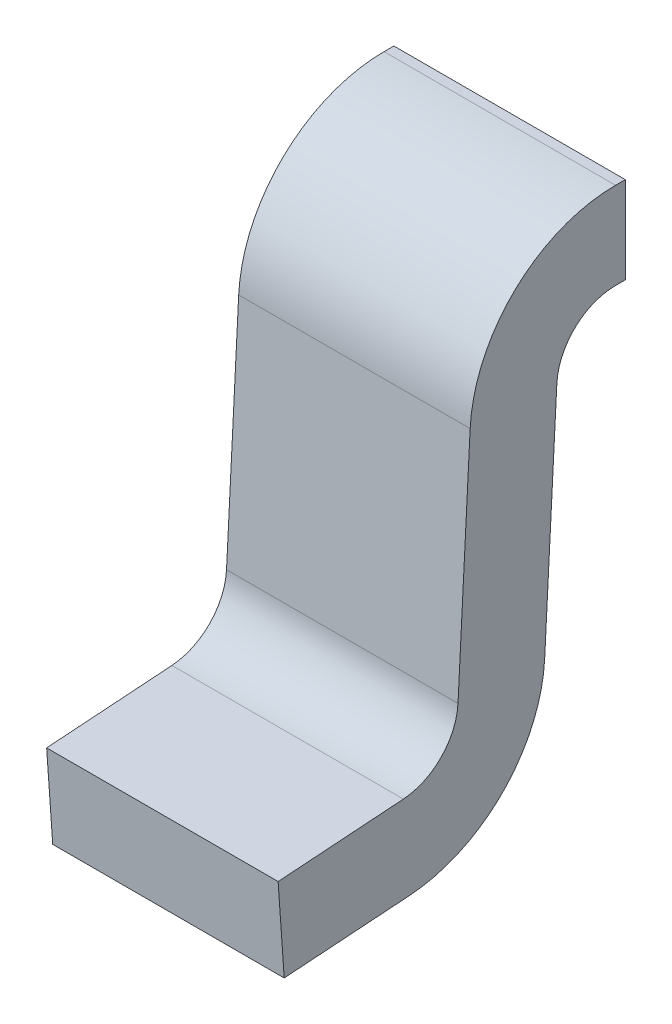
ISO-10303-21;
HEADER;
FILE_DESCRIPTION(('STEP AP214'),'2;1');
FILE_NAME('part.step','',(''),(''),'','','');
FILE_SCHEMA(('AUTOMOTIVE_DESIGN { 1 0 10303 214 1 1 1 1 }'));
ENDSEC;
DATA;
#1=APPLICATION_CONTEXT('core data for automotive mechanical design processes');
#2=APPLICATION_PROTOCOL_DEFINITION('international standard','automotive_design',2000,#1);
#3=PRODUCT_CONTEXT('',#1,'mechanical');
#4=PRODUCT('Part','Part','',(#3));
#5=PRODUCT_RELATED_PRODUCT_CATEGORY('part','',(#4));
#6=PRODUCT_DEFINITION_FORMATION('','',#4);
#7=PRODUCT_DEFINITION_CONTEXT('part definition',#1,'design');
#8=PRODUCT_DEFINITION('design','',#6,#7);
#9=PRODUCT_DEFINITION_SHAPE('','',#8);
#10=(LENGTH_UNIT() NAMED_UNIT(*) SI_UNIT(.MILLI.,.METRE.));
#11=(NAMED_UNIT(*) PLANE_ANGLE_UNIT() SI_UNIT($,.RADIAN.));
#12=(NAMED_UNIT(*) SI_UNIT($,.STERADIAN.) SOLID_ANGLE_UNIT());
#13=UNCERTAINTY_MEASURE_WITH_UNIT(LENGTH_MEASURE(1.E-05),#10,'distance_accuracy_value','');
#14=(GEOMETRIC_REPRESENTATION_CONTEXT(3) GLOBAL_UNCERTAINTY_ASSIGNED_CONTEXT((#13)) GLOBAL_UNIT_ASSIGNED_CONTEXT((#10,
#11,#12)) REPRESENTATION_CONTEXT('',''));
#15=CARTESIAN_POINT('',(0.,0.,0.));
#16=DIRECTION('',(0.,0.,1.));
#17=DIRECTION('',(1.,0.,0.));
#18=AXIS2_PLACEMENT_3D('',#15,#16,#17);
#19=CARTESIAN_POINT('',(-0.2,0.01612280193581,0.251100322008));
#20=DIRECTION('',(-1.,0.,0.));
#21=DIRECTION('',(0.,-0.0523359562429177,-0.998629534754575));
#22=AXIS2_PLACEMENT_3D('',#19,#20,#21);
#23=CYLINDRICAL_SURFACE('',#22,0.2516);
#24=CARTESIAN_POINT('',(0.2,0.01612280193581,0.251100322008));
#25=DIRECTION('',(-1.,0.,0.));
#26=DIRECTION('',(0.,-0.0523359562429177,-0.998629534754575));
#27=AXIS2_PLACEMENT_3D('',#24,#25,#26);
#28=CIRCLE('',#27,0.2516);
#29=CARTESIAN_POINT('',(0.2,0.002955075345083,-0.0001548689364499));
#30=VERTEX_POINT('',#29);
#31=CARTESIAN_POINT('',(0.2,-0.23486431311,0.233549593214));
#32=VERTEX_POINT('',#31);
#33=EDGE_CURVE('E228',#30,#32,#28,.T.);
#34=ORIENTED_EDGE('',*,*,#33,.T.);
#35=DIRECTION('',(1.,0.,0.));
#36=VECTOR('',#35,1.);
#37=CARTESIAN_POINT('',(-0.2,-0.23486431311,0.233549593214));
#38=LINE('',#37,#36);
#39=CARTESIAN_POINT('',(-0.2,-0.23486431311,0.233549593214));
#40=VERTEX_POINT('',#39);
#41=EDGE_CURVE('E11',#40,#32,#38,.T.);
#42=ORIENTED_EDGE('',*,*,#41,.F.);
#43=CARTESIAN_POINT('',(-0.2,0.01612280193581,0.251100322008));
#44=DIRECTION('',(-1.,0.,0.));
#45=DIRECTION('',(0.,-0.0523359562429177,-0.998629534754575));
#46=AXIS2_PLACEMENT_3D('',#43,#44,#45);
#47=CIRCLE('',#46,0.2516);
#48=CARTESIAN_POINT('',(-0.2,0.002955075345083,-0.0001548689364499));
#49=VERTEX_POINT('',#48);
#50=EDGE_CURVE('E156',#49,#40,#47,.T.);
#51=ORIENTED_EDGE('',*,*,#50,.F.);
#52=DIRECTION('',(1.,0.,0.));
#53=VECTOR('',#52,1.);
#54=CARTESIAN_POINT('',(-0.2,0.002955075345083,-0.0001548689364499));
#55=LINE('',#54,#53);
#56=EDGE_CURVE('E138',#49,#30,#55,.T.);
#57=ORIENTED_EDGE('',*,*,#56,.T.);
#58=EDGE_LOOP('',(#34,#42,#51,#57));
#59=FACE_BOUND('',#58,.T.);
#60=ADVANCED_FACE('F17',(#59),#23,.T.);
#61=CARTESIAN_POINT('',(-0.2,-0.25,0.45));
#62=DIRECTION('',(0.,-0.997564050259825,-0.0697564737441177));
#63=DIRECTION('',(0.,0.0697564737441177,-0.997564050259825));
#64=AXIS2_PLACEMENT_3D('',#61,#62,#63);
#65=PLANE('',#64);
#66=ORIENTED_EDGE('',*,*,#41,.T.);
#67=DIRECTION('',(0.,0.0697564737441177,-0.997564050259825));
#68=VECTOR('',#67,1.);
#69=CARTESIAN_POINT('',(0.2,-0.25,0.45));
#70=LINE('',#69,#68);
#71=CARTESIAN_POINT('',(0.2,-0.25,0.45));
#72=VERTEX_POINT('',#71);
#73=EDGE_CURVE('E224',#72,#32,#70,.T.);
#74=ORIENTED_EDGE('',*,*,#73,.F.);
#75=DIRECTION('',(1.,0.,0.));
#76=VECTOR('',#75,1.);
#77=CARTESIAN_POINT('',(-0.2,-0.25,0.45));
#78=LINE('',#77,#76);
#79=CARTESIAN_POINT('',(-0.2,-0.25,0.45));
#80=VERTEX_POINT('',#79);
#81=EDGE_CURVE('E26',#80,#72,#78,.T.);
#82=ORIENTED_EDGE('',*,*,#81,.F.);
#83=DIRECTION('',(0.,0.0697564737441177,-0.997564050259825));
#84=VECTOR('',#83,1.);
#85=CARTESIAN_POINT('',(-0.2,-0.25,0.45));
#86=LINE('',#85,#84);
#87=EDGE_CURVE('E164',#80,#40,#86,.T.);
#88=ORIENTED_EDGE('',*,*,#87,.T.);
#89=EDGE_LOOP('',(#66,#74,#82,#88));
#90=FACE_BOUND('',#89,.T.);
#91=ADVANCED_FACE('F279',(#90),#65,.T.);
#92=CARTESIAN_POINT('',(-0.2,-0.100365392461,0.460463471062));
#93=DIRECTION('',(0.,-0.0697564737441177,0.997564050259825));
#94=DIRECTION('',(-1.,0.,0.));
#95=AXIS2_PLACEMENT_3D('',#92,#93,#94);
#96=PLANE('',#95);
#97=ORIENTED_EDGE('',*,*,#81,.T.);
#98=DIRECTION('',(0.,-0.997564050259825,-0.0697564737441177));
#99=VECTOR('',#98,1.);
#100=CARTESIAN_POINT('',(0.2,-0.100365392461,0.460463471062));
#101=LINE('',#100,#99);
#102=CARTESIAN_POINT('',(0.2,-0.100365392461,0.460463471062));
#103=VERTEX_POINT('',#102);
#104=EDGE_CURVE('E216',#103,#72,#101,.T.);
#105=ORIENTED_EDGE('',*,*,#104,.F.);
#106=DIRECTION('',(1.,0.,0.));
#107=VECTOR('',#106,1.);
#108=CARTESIAN_POINT('',(-0.2,-0.100365392461,0.460463471062));
#109=LINE('',#108,#107);
#110=CARTESIAN_POINT('',(-0.2,-0.100365392461,0.460463471062));
#111=VERTEX_POINT('',#110);
#112=EDGE_CURVE('E268',#111,#103,#109,.T.);
#113=ORIENTED_EDGE('',*,*,#112,.F.);
#114=DIRECTION('',(0.,-0.997564050259825,-0.0697564737441177));
#115=VECTOR('',#114,1.);
#116=CARTESIAN_POINT('',(-0.2,-0.100365392461,0.460463471062));
#117=LINE('',#116,#115);
#118=EDGE_CURVE('E170',#111,#80,#117,.T.);
#119=ORIENTED_EDGE('',*,*,#118,.T.);
#120=EDGE_LOOP('',(#97,#105,#113,#119));
#121=FACE_BOUND('',#120,.T.);
#122=ADVANCED_FACE('F276',(#121),#96,.T.);
#123=CARTESIAN_POINT('',(-0.2,-0.07895942959831,0.154343940258));
#124=DIRECTION('',(0.,0.997564050259825,0.0697564737441177));
#125=DIRECTION('',(1.,0.,0.));
#126=AXIS2_PLACEMENT_3D('',#123,#124,#125);
#127=PLANE('',#126);
#128=ORIENTED_EDGE('',*,*,#112,.T.);
#129=DIRECTION('',(0.,-0.0697564737441177,0.997564050259825));
#130=VECTOR('',#129,1.);
#131=CARTESIAN_POINT('',(0.2,-0.08522970557059,0.244013064275));
#132=LINE('',#131,#130);
#133=CARTESIAN_POINT('',(0.2,-0.08522970557059,0.244013064275));
#134=VERTEX_POINT('',#133);
#135=EDGE_CURVE('E212',#134,#103,#132,.T.);
#136=ORIENTED_EDGE('',*,*,#135,.F.);
#137=DIRECTION('',(1.,0.,0.));
#138=VECTOR('',#137,1.);
#139=CARTESIAN_POINT('',(-0.2,-0.08522970557059,0.244013064275));
#140=LINE('',#139,#138);
#141=CARTESIAN_POINT('',(-0.2,-0.08522970557059,0.244013064275));
#142=VERTEX_POINT('',#141);
#143=EDGE_CURVE('E265',#142,#134,#140,.T.);
#144=ORIENTED_EDGE('',*,*,#143,.F.);
#145=DIRECTION('',(0.,-0.0697564737441177,0.997564050259825));
#146=VECTOR('',#145,1.);
#147=CARTESIAN_POINT('',(-0.2,-0.08522970557059,0.244013064275));
#148=LINE('',#147,#146);
#149=EDGE_CURVE('E178',#142,#111,#148,.T.);
#150=ORIENTED_EDGE('',*,*,#149,.T.);
#151=EDGE_LOOP('',(#128,#136,#144,#150));
#152=FACE_BOUND('',#151,.T.);
#153=ADVANCED_FACE('F19',(#152),#127,.T.);
#154=CARTESIAN_POINT('',(-0.2,0.01612280193581,0.251100322008));
#155=DIRECTION('',(1.,0.,0.));
#156=DIRECTION('',(0.,-0.997564050259826,-0.0697564737441078));
#157=AXIS2_PLACEMENT_3D('',#154,#155,#156);
#158=CYLINDRICAL_SURFACE('',#157,0.1016);
#159=CARTESIAN_POINT('',(0.2,0.01612280193581,0.251100322008));
#160=DIRECTION('',(1.,0.,0.));
#161=DIRECTION('',(0.,-0.997564050259825,-0.0697564737441177));
#162=AXIS2_PLACEMENT_3D('',#159,#160,#161);
#163=CIRCLE('',#162,0.1016);
#164=CARTESIAN_POINT('',(0.2,0.01080546878153,0.149639561277));
#165=VERTEX_POINT('',#164);
#166=EDGE_CURVE('E203',#134,#165,#163,.T.);
#167=ORIENTED_EDGE('',*,*,#166,.T.);
#168=DIRECTION('',(1.,0.,0.));
#169=VECTOR('',#168,1.);
#170=CARTESIAN_POINT('',(-0.2,0.01080546878153,0.149639561277));
#171=LINE('',#170,#169);
#172=CARTESIAN_POINT('',(-0.2,0.01080546878153,0.149639561277));
#173=VERTEX_POINT('',#172);
#174=EDGE_CURVE('E253',#173,#165,#171,.T.);
#175=ORIENTED_EDGE('',*,*,#174,.F.);
#176=CARTESIAN_POINT('',(-0.2,0.01612280193581,0.251100322008));
#177=DIRECTION('',(1.,0.,0.));
#178=DIRECTION('',(0.,-0.997564050259825,-0.0697564737441177));
#179=AXIS2_PLACEMENT_3D('',#176,#177,#178);
#180=CIRCLE('',#179,0.1016);
#181=EDGE_CURVE('E185',#142,#173,#180,.T.);
#182=ORIENTED_EDGE('',*,*,#181,.F.);
#183=ORIENTED_EDGE('',*,*,#143,.T.);
#184=EDGE_LOOP('',(#167,#175,#182,#183));
#185=FACE_BOUND('',#184,.T.);
#186=ADVANCED_FACE('F289',(#185),#158,.F.);
#187=CARTESIAN_POINT('',(-0.2,0.3984,-0.12261868962));
#188=DIRECTION('',(1.,0.,0.));
#189=DIRECTION('',(0.,1.,0.));
#190=AXIS2_PLACEMENT_3D('',#187,#188,#189);
#191=CYLINDRICAL_SURFACE('',#190,0.1016);
#192=CARTESIAN_POINT('',(0.2,0.3984,-0.12261868962));
#193=DIRECTION('',(1.,0.,0.));
#194=DIRECTION('',(0.,1.,0.));
#195=AXIS2_PLACEMENT_3D('',#192,#193,#194);
#196=CIRCLE('',#195,0.1016);
#197=CARTESIAN_POINT('',(0.2,0.5,-0.12261868962));
#198=VERTEX_POINT('',#197);
#199=CARTESIAN_POINT('',(0.2,0.403717333154,-0.02115792888869));
#200=VERTEX_POINT('',#199);
#201=EDGE_CURVE('E231',#198,#200,#196,.T.);
#202=ORIENTED_EDGE('',*,*,#201,.T.);
#203=DIRECTION('',(1.,0.,0.));
#204=VECTOR('',#203,1.);
#205=CARTESIAN_POINT('',(-0.2,0.403717333154,-0.02115792888869));
#206=LINE('',#205,#204);
#207=CARTESIAN_POINT('',(-0.2,0.403717333154,-0.02115792888869));
#208=VERTEX_POINT('',#207);
#209=EDGE_CURVE('E150',#208,#200,#206,.T.);
#210=ORIENTED_EDGE('',*,*,#209,.F.);
#211=CARTESIAN_POINT('',(-0.2,0.3984,-0.12261868962));
#212=DIRECTION('',(1.,0.,0.));
#213=DIRECTION('',(0.,1.,0.));
#214=AXIS2_PLACEMENT_3D('',#211,#212,#213);
#215=CIRCLE('',#214,0.1016);
#216=CARTESIAN_POINT('',(-0.2,0.5,-0.12261868962));
#217=VERTEX_POINT('',#216);
#218=EDGE_CURVE('E159',#217,#208,#215,.T.);
#219=ORIENTED_EDGE('',*,*,#218,.F.);
#220=DIRECTION('',(1.,0.,0.));
#221=VECTOR('',#220,1.);
#222=CARTESIAN_POINT('',(-0.2,0.5,-0.12261868962));
#223=LINE('',#222,#221);
#224=EDGE_CURVE('E262',#217,#198,#223,.T.);
#225=ORIENTED_EDGE('',*,*,#224,.T.);
#226=EDGE_LOOP('',(#202,#210,#219,#225));
#227=FACE_BOUND('',#226,.T.);
#228=ADVANCED_FACE('F440',(#227),#191,.F.);
#229=CARTESIAN_POINT('',(-0.2,0.5,-0.02620388964152));
#230=DIRECTION('',(0.,-1.,0.));
#231=DIRECTION('',(0.,0.,-1.));
#232=AXIS2_PLACEMENT_3D('',#229,#230,#231);
#233=PLANE('',#232);
#234=DIRECTION('',(1.,0.,0.));
#235=VECTOR('',#234,1.);
#236=CARTESIAN_POINT('',(-0.2,0.5,-0.139536528938));
#237=LINE('',#236,#235);
#238=CARTESIAN_POINT('',(-0.2,0.5,-0.139536528938));
#239=VERTEX_POINT('',#238);
#240=CARTESIAN_POINT('',(0.2,0.5,-0.139536528938));
#241=VERTEX_POINT('',#240);
#242=EDGE_CURVE('E220',#239,#241,#237,.T.);
#243=ORIENTED_EDGE('',*,*,#242,.T.);
#244=DIRECTION('',(0.,0.,-1.));
#245=VECTOR('',#244,1.);
#246=CARTESIAN_POINT('',(0.2,0.5,-0.12261868962));
#247=LINE('',#246,#245);
#248=EDGE_CURVE('E234',#198,#241,#247,.T.);
#249=ORIENTED_EDGE('',*,*,#248,.F.);
#250=ORIENTED_EDGE('',*,*,#224,.F.);
#251=DIRECTION('',(0.,0.,-1.));
#252=VECTOR('',#251,1.);
#253=CARTESIAN_POINT('',(-0.2,0.5,-0.12261868962));
#254=LINE('',#253,#252);
#255=EDGE_CURVE('E181',#217,#239,#254,.T.);
#256=ORIENTED_EDGE('',*,*,#255,.T.);
#257=EDGE_LOOP('',(#243,#249,#250,#256));
#258=FACE_BOUND('',#257,.T.);
#259=ADVANCED_FACE('F434',(#258),#233,.T.);
#260=CARTESIAN_POINT('',(-0.2,0.5,-0.139536528938));
#261=DIRECTION('',(0.,0.,-1.));
#262=DIRECTION('',(0.,-1.,0.));
#263=AXIS2_PLACEMENT_3D('',#260,#261,#262);
#264=PLANE('',#263);
#265=DIRECTION('',(1.,0.,0.));
#266=VECTOR('',#265,1.);
#267=CARTESIAN_POINT('',(-0.2,0.65,-0.139536528938));
#268=LINE('',#267,#266);
#269=CARTESIAN_POINT('',(-0.2,0.65,-0.139536528938));
#270=VERTEX_POINT('',#269);
#271=CARTESIAN_POINT('',(0.2,0.65,-0.139536528938));
#272=VERTEX_POINT('',#271);
#273=EDGE_CURVE('E217',#270,#272,#268,.T.);
#274=ORIENTED_EDGE('',*,*,#273,.T.);
#275=DIRECTION('',(0.,1.,0.));
#276=VECTOR('',#275,1.);
#277=CARTESIAN_POINT('',(0.2,0.5,-0.139536528938));
#278=LINE('',#277,#276);
#279=EDGE_CURVE('E238',#241,#272,#278,.T.);
#280=ORIENTED_EDGE('',*,*,#279,.F.);
#281=ORIENTED_EDGE('',*,*,#242,.F.);
#282=DIRECTION('',(0.,1.,0.));
#283=VECTOR('',#282,1.);
#284=CARTESIAN_POINT('',(-0.2,0.5,-0.139536528938));
#285=LINE('',#284,#283);
#286=EDGE_CURVE('E193',#239,#270,#285,.T.);
#287=ORIENTED_EDGE('',*,*,#286,.T.);
#288=EDGE_LOOP('',(#274,#280,#281,#287));
#289=FACE_BOUND('',#288,.T.);
#290=ADVANCED_FACE('F439',(#289),#264,.T.);
#291=CARTESIAN_POINT('',(-0.2,0.65,-0.139536528938));
#292=DIRECTION('',(0.,1.,0.));
#293=DIRECTION('',(1.,0.,0.));
#294=AXIS2_PLACEMENT_3D('',#291,#292,#293);
#295=PLANE('',#294);
#296=DIRECTION('',(1.,0.,0.));
#297=VECTOR('',#296,1.);
#298=CARTESIAN_POINT('',(-0.2,0.65,-0.12261868962));
#299=LINE('',#298,#297);
#300=CARTESIAN_POINT('',(-0.2,0.65,-0.12261868962));
#301=VERTEX_POINT('',#300);
#302=CARTESIAN_POINT('',(0.2,0.65,-0.12261868962));
#303=VERTEX_POINT('',#302);
#304=EDGE_CURVE('E48',#301,#303,#299,.T.);
#305=ORIENTED_EDGE('',*,*,#304,.T.);
#306=DIRECTION('',(0.,0.,1.));
#307=VECTOR('',#306,1.);
#308=CARTESIAN_POINT('',(0.2,0.65,-0.139536528938));
#309=LINE('',#308,#307);
#310=EDGE_CURVE('E242',#272,#303,#309,.T.);
#311=ORIENTED_EDGE('',*,*,#310,.F.);
#312=ORIENTED_EDGE('',*,*,#273,.F.);
#313=DIRECTION('',(0.,0.,1.));
#314=VECTOR('',#313,1.);
#315=CARTESIAN_POINT('',(-0.2,0.65,-0.139536528938));
#316=LINE('',#315,#314);
#317=EDGE_CURVE('E173',#270,#301,#316,.T.);
#318=ORIENTED_EDGE('',*,*,#317,.T.);
#319=EDGE_LOOP('',(#305,#311,#312,#318));
#320=FACE_BOUND('',#319,.T.);
#321=ADVANCED_FACE('F464',(#320),#295,.T.);
#322=CARTESIAN_POINT('',(-0.2,0.3984,-0.12261868962));
#323=DIRECTION('',(-1.,0.,0.));
#324=DIRECTION('',(0.,0.0523359562429177,0.998629534754575));
#325=AXIS2_PLACEMENT_3D('',#322,#323,#324);
#326=CYLINDRICAL_SURFACE('',#325,0.2516);
#327=CARTESIAN_POINT('',(0.2,0.3984,-0.12261868962));
#328=DIRECTION('',(-1.,0.,0.));
#329=DIRECTION('',(0.,0.0523359562429177,0.998629534754575));
#330=AXIS2_PLACEMENT_3D('',#327,#328,#329);
#331=CIRCLE('',#330,0.2516);
#332=CARTESIAN_POINT('',(0.2,0.411567726591,0.128636501324));
#333=VERTEX_POINT('',#332);
#334=EDGE_CURVE('E246',#333,#303,#331,.T.);
#335=ORIENTED_EDGE('',*,*,#334,.T.);
#336=ORIENTED_EDGE('',*,*,#304,.F.);
#337=CARTESIAN_POINT('',(-0.2,0.3984,-0.12261868962));
#338=DIRECTION('',(-1.,0.,0.));
#339=DIRECTION('',(0.,0.0523359562429177,0.998629534754575));
#340=AXIS2_PLACEMENT_3D('',#337,#338,#339);
#341=CIRCLE('',#340,0.2516);
#342=CARTESIAN_POINT('',(-0.2,0.411567726591,0.128636501324));
#343=VERTEX_POINT('',#342);
#344=EDGE_CURVE('E197',#343,#301,#341,.T.);
#345=ORIENTED_EDGE('',*,*,#344,.F.);
#346=DIRECTION('',(1.,0.,0.));
#347=VECTOR('',#346,1.);
#348=CARTESIAN_POINT('',(-0.2,0.411567726591,0.128636501324));
#349=LINE('',#348,#347);
#350=EDGE_CURVE('E38',#343,#333,#349,.T.);
#351=ORIENTED_EDGE('',*,*,#350,.T.);
#352=EDGE_LOOP('',(#335,#336,#345,#351));
#353=FACE_BOUND('',#352,.T.);
#354=ADVANCED_FACE('F293',(#353),#326,.T.);
#355=CARTESIAN_POINT('',(-0.2,0.007850393436442,0.149794430213));
#356=DIRECTION('',(0.,0.0523359562429177,0.998629534754575));
#357=DIRECTION('',(1.,0.,0.));
#358=AXIS2_PLACEMENT_3D('',#355,#356,#357);
#359=PLANE('',#358);
#360=ORIENTED_EDGE('',*,*,#174,.T.);
#361=DIRECTION('',(0.,-0.998629534754575,0.0523359562429177));
#362=VECTOR('',#361,1.);
#363=CARTESIAN_POINT('',(0.2,0.411567726591,0.128636501324));
#364=LINE('',#363,#362);
#365=EDGE_CURVE('E249',#333,#165,#364,.T.);
#366=ORIENTED_EDGE('',*,*,#365,.F.);
#367=ORIENTED_EDGE('',*,*,#350,.F.);
#368=DIRECTION('',(0.,0.998629534754575,-0.0523359562429177));
#369=VECTOR('',#368,1.);
#370=CARTESIAN_POINT('',(-0.2,0.01080546878153,0.149639561277));
#371=LINE('',#370,#369);
#372=EDGE_CURVE('E189',#173,#343,#371,.T.);
#373=ORIENTED_EDGE('',*,*,#372,.F.);
#374=EDGE_LOOP('',(#360,#366,#367,#373));
#375=FACE_BOUND('',#374,.T.);
#376=ADVANCED_FACE('F291',(#375),#359,.T.);
#377=CARTESIAN_POINT('',(0.2,0.,0.));
#378=DIRECTION('',(1.,0.,0.));
#379=DIRECTION('',(0.,1.,0.));
#380=AXIS2_PLACEMENT_3D('',#377,#378,#379);
#381=PLANE('',#380);
#382=ORIENTED_EDGE('',*,*,#166,.F.);
#383=ORIENTED_EDGE('',*,*,#135,.T.);
#384=ORIENTED_EDGE('',*,*,#104,.T.);
#385=ORIENTED_EDGE('',*,*,#73,.T.);
#386=ORIENTED_EDGE('',*,*,#33,.F.);
#387=DIRECTION('',(0.,0.998629534754575,-0.0523359562429177));
#388=VECTOR('',#387,1.);
#389=CARTESIAN_POINT('',(0.2,0.002955075345083,-0.0001548689364499));
#390=LINE('',#389,#388);
#391=EDGE_CURVE('E145',#30,#200,#390,.T.);
#392=ORIENTED_EDGE('',*,*,#391,.T.);
#393=ORIENTED_EDGE('',*,*,#201,.F.);
#394=ORIENTED_EDGE('',*,*,#248,.T.);
#395=ORIENTED_EDGE('',*,*,#279,.T.);
#396=ORIENTED_EDGE('',*,*,#310,.T.);
#397=ORIENTED_EDGE('',*,*,#334,.F.);
#398=ORIENTED_EDGE('',*,*,#365,.T.);
#399=EDGE_LOOP('',(#382,#383,#384,#385,#386,#392,#393,#394,#395,#396,#397,#398));
#400=FACE_BOUND('',#399,.T.);
#401=ADVANCED_FACE('F282',(#400),#381,.T.);
#402=CARTESIAN_POINT('',(-0.2,-0.219336739934,0.01149495145513));
#403=DIRECTION('',(0.,-0.0523359562429177,-0.998629534754575));
#404=DIRECTION('',(0.,-0.998629534754575,0.0523359562429177));
#405=AXIS2_PLACEMENT_3D('',#402,#403,#404);
#406=PLANE('',#405);
#407=ORIENTED_EDGE('',*,*,#56,.F.);
#408=DIRECTION('',(0.,-0.998629534754575,0.0523359562429177));
#409=VECTOR('',#408,1.);
#410=CARTESIAN_POINT('',(-0.2,0.403717333154,-0.02115792888869));
#411=LINE('',#410,#409);
#412=EDGE_CURVE('E142',#208,#49,#411,.T.);
#413=ORIENTED_EDGE('',*,*,#412,.F.);
#414=ORIENTED_EDGE('',*,*,#209,.T.);
#415=ORIENTED_EDGE('',*,*,#391,.F.);
#416=EDGE_LOOP('',(#407,#413,#414,#415));
#417=FACE_BOUND('',#416,.T.);
#418=ADVANCED_FACE('F140',(#417),#406,.T.);
#419=CARTESIAN_POINT('',(-0.2,0.,0.));
#420=DIRECTION('',(1.,0.,0.));
#421=DIRECTION('',(0.,1.,0.));
#422=AXIS2_PLACEMENT_3D('',#419,#420,#421);
#423=PLANE('',#422);
#424=ORIENTED_EDGE('',*,*,#50,.T.);
#425=ORIENTED_EDGE('',*,*,#87,.F.);
#426=ORIENTED_EDGE('',*,*,#118,.F.);
#427=ORIENTED_EDGE('',*,*,#149,.F.);
#428=ORIENTED_EDGE('',*,*,#181,.T.);
#429=ORIENTED_EDGE('',*,*,#372,.T.);
#430=ORIENTED_EDGE('',*,*,#344,.T.);
#431=ORIENTED_EDGE('',*,*,#317,.F.);
#432=ORIENTED_EDGE('',*,*,#286,.F.);
#433=ORIENTED_EDGE('',*,*,#255,.F.);
#434=ORIENTED_EDGE('',*,*,#218,.T.);
#435=ORIENTED_EDGE('',*,*,#412,.T.);
#436=EDGE_LOOP('',(#424,#425,#426,#427,#428,#429,#430,#431,#432,#433,#434,#435));
#437=FACE_BOUND('',#436,.T.);
#438=ADVANCED_FACE('F154',(#437),#423,.F.);
#439=CLOSED_SHELL('',(#60,#91,#122,#153,#186,#228,#259,#290,#321,#354,#376,#401,#418,#438));
#440=MANIFOLD_SOLID_BREP('B1',#439);
#441=ADVANCED_BREP_SHAPE_REPRESENTATION('',(#18,#440),#14);
#442=SHAPE_DEFINITION_REPRESENTATION(#9,#441);
ENDSEC;
END-ISO-10303-21;
